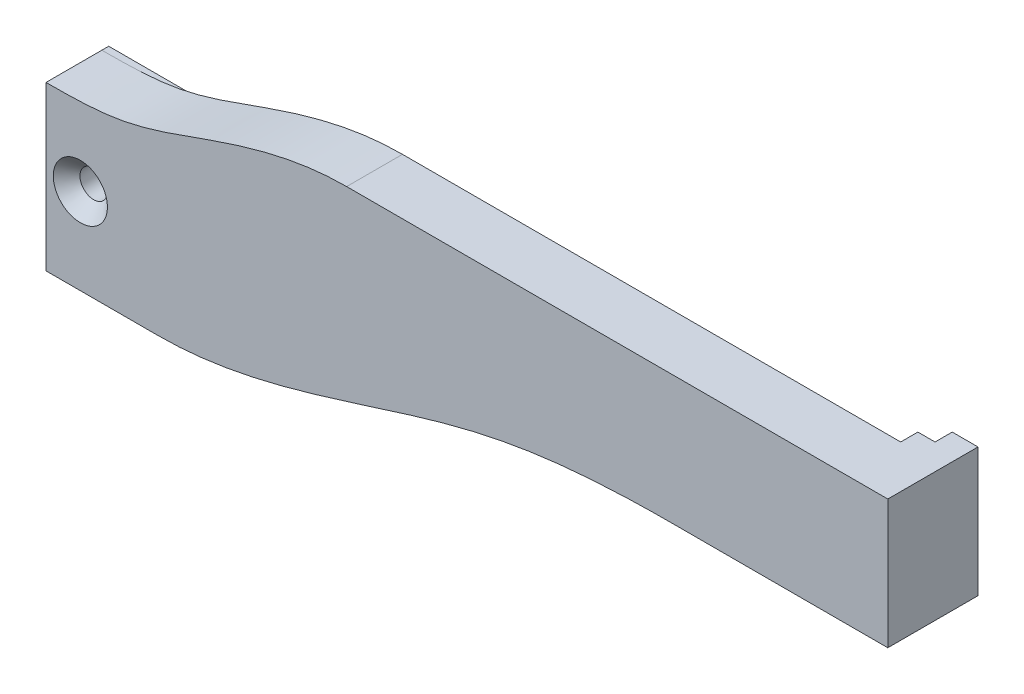
ISO-10303-21;
HEADER;
FILE_DESCRIPTION(('STEP AP214'),'2;1');
FILE_NAME('part.step','',(''),(''),'','','');
FILE_SCHEMA(('AUTOMOTIVE_DESIGN { 1 0 10303 214 1 1 1 1 }'));
ENDSEC;
DATA;
#1=APPLICATION_CONTEXT('core data for automotive mechanical design processes');
#2=APPLICATION_PROTOCOL_DEFINITION('international standard','automotive_design',2000,#1);
#3=PRODUCT_CONTEXT('',#1,'mechanical');
#4=PRODUCT('Part','Part','',(#3));
#5=PRODUCT_RELATED_PRODUCT_CATEGORY('part','',(#4));
#6=PRODUCT_DEFINITION_FORMATION('','',#4);
#7=PRODUCT_DEFINITION_CONTEXT('part definition',#1,'design');
#8=PRODUCT_DEFINITION('design','',#6,#7);
#9=PRODUCT_DEFINITION_SHAPE('','',#8);
#10=(LENGTH_UNIT() NAMED_UNIT(*) SI_UNIT(.MILLI.,.METRE.));
#11=(NAMED_UNIT(*) PLANE_ANGLE_UNIT() SI_UNIT($,.RADIAN.));
#12=(NAMED_UNIT(*) SI_UNIT($,.STERADIAN.) SOLID_ANGLE_UNIT());
#13=UNCERTAINTY_MEASURE_WITH_UNIT(LENGTH_MEASURE(1.E-05),#10,'distance_accuracy_value','');
#14=(GEOMETRIC_REPRESENTATION_CONTEXT(3) GLOBAL_UNCERTAINTY_ASSIGNED_CONTEXT((#13)) GLOBAL_UNIT_ASSIGNED_CONTEXT((#10,
#11,#12)) REPRESENTATION_CONTEXT('',''));
#15=CARTESIAN_POINT('',(0.,0.,0.));
#16=DIRECTION('',(0.,0.,1.));
#17=DIRECTION('',(1.,0.,0.));
#18=AXIS2_PLACEMENT_3D('',#15,#16,#17);
#19=CARTESIAN_POINT('',(0.,0.,0.));
#20=DIRECTION('',(0.,0.,-1.));
#21=DIRECTION('',(-1.,0.,0.));
#22=AXIS2_PLACEMENT_3D('',#19,#20,#21);
#23=PLANE('',#22);
#24=CARTESIAN_POINT('',(-49.7226680854989,56.4584902718559,0.));
#25=DIRECTION('',(0.,0.,-1.));
#26=DIRECTION('',(-1.,0.,0.));
#27=AXIS2_PLACEMENT_3D('',#24,#25,#26);
#28=CIRCLE('',#27,1.59999999999999);
#29=CARTESIAN_POINT('',(-51.3226680854989,56.4584902718559,0.));
#30=VERTEX_POINT('',#29);
#31=EDGE_CURVE('E41',#30,#30,#28,.T.);
#32=ORIENTED_EDGE('',*,*,#31,.F.);
#33=EDGE_LOOP('',(#32));
#34=FACE_BOUND('',#33,.T.);
#35=CARTESIAN_POINT('',(-44.1226680854821,62.0584902718545,0.));
#36=DIRECTION('',(0.,0.,1.));
#37=DIRECTION('',(-1.,0.,0.));
#38=AXIS2_PLACEMENT_3D('',#35,#36,#37);
#39=CIRCLE('',#38,0.899999999999998);
#40=CARTESIAN_POINT('',(-43.2226680854821,62.0584902718545,0.));
#41=VERTEX_POINT('',#40);
#42=CARTESIAN_POINT('',(-44.1226680854821,62.9584902718545,0.));
#43=VERTEX_POINT('',#42);
#44=EDGE_CURVE('E247',#41,#43,#39,.T.);
#45=ORIENTED_EDGE('',*,*,#44,.F.);
#46=DIRECTION('',(0.,1.,0.));
#47=VECTOR('',#46,1.);
#48=CARTESIAN_POINT('',(-43.2226680854821,62.0584902718545,0.));
#49=LINE('',#48,#47);
#50=CARTESIAN_POINT('',(-43.2226680854821,46.4584902718545,0.));
#51=VERTEX_POINT('',#50);
#52=EDGE_CURVE('E225',#51,#41,#49,.T.);
#53=ORIENTED_EDGE('',*,*,#52,.F.);
#54=DIRECTION('',(1.,0.,0.));
#55=VECTOR('',#54,1.);
#56=CARTESIAN_POINT('',(-53.7226680854821,46.4584902718545,0.));
#57=LINE('',#56,#55);
#58=CARTESIAN_POINT('',(-53.7226680854821,46.4584902718545,0.));
#59=VERTEX_POINT('',#58);
#60=EDGE_CURVE('E359',#59,#51,#57,.T.);
#61=ORIENTED_EDGE('',*,*,#60,.F.);
#62=DIRECTION('',(0.,-1.,0.));
#63=VECTOR('',#62,1.);
#64=CARTESIAN_POINT('',(-53.7226680854821,46.4584902718545,0.));
#65=LINE('',#64,#63);
#66=CARTESIAN_POINT('',(-53.7226680854821,62.9584902718545,0.));
#67=VERTEX_POINT('',#66);
#68=EDGE_CURVE('E346',#67,#59,#65,.T.);
#69=ORIENTED_EDGE('',*,*,#68,.F.);
#70=DIRECTION('',(-1.,0.,0.));
#71=VECTOR('',#70,1.);
#72=CARTESIAN_POINT('',(-53.7226680854821,62.9584902718545,0.));
#73=LINE('',#72,#71);
#74=EDGE_CURVE('E249',#43,#67,#73,.T.);
#75=ORIENTED_EDGE('',*,*,#74,.F.);
#76=EDGE_LOOP('',(#45,#53,#61,#69,#75));
#77=FACE_BOUND('',#76,.T.);
#78=ADVANCED_FACE('F36',(#34,#77),#23,.T.);
#79=CARTESIAN_POINT('',(-19.6476680854999,68.8834902718559,0.));
#80=DIRECTION('',(0.,0.,-1.));
#81=DIRECTION('',(-1.,0.,0.));
#82=AXIS2_PLACEMENT_3D('',#79,#80,#81);
#83=CIRCLE('',#82,2.);
#84=CARTESIAN_POINT('',(-21.6476680854999,68.8834902718559,0.));
#85=VERTEX_POINT('',#84);
#86=EDGE_CURVE('E527',#85,#85,#83,.T.);
#87=ORIENTED_EDGE('',*,*,#86,.F.);
#88=EDGE_LOOP('',(#87));
#89=FACE_BOUND('',#88,.T.);
#90=DIRECTION('',(0.707106781186547,-0.707106781186547,0.));
#91=VECTOR('',#90,1.);
#92=CARTESIAN_POINT('',(-40.7226680854821,64.9584902718545,0.));
#93=LINE('',#92,#91);
#94=CARTESIAN_POINT('',(-41.2226680854821,65.4584902718545,0.));
#95=VERTEX_POINT('',#94);
#96=CARTESIAN_POINT('',(-40.7226680854821,64.9584902718545,0.));
#97=VERTEX_POINT('',#96);
#98=EDGE_CURVE('E253',#95,#97,#93,.T.);
#99=ORIENTED_EDGE('',*,*,#98,.F.);
#100=DIRECTION('',(1.,0.,0.));
#101=VECTOR('',#100,1.);
#102=CARTESIAN_POINT('',(-41.2226680854821,65.4584902718545,0.));
#103=LINE('',#102,#101);
#104=CARTESIAN_POINT('',(-53.7226680854821,65.4584902718545,0.));
#105=VERTEX_POINT('',#104);
#106=EDGE_CURVE('E251',#105,#95,#103,.T.);
#107=ORIENTED_EDGE('',*,*,#106,.F.);
#108=CARTESIAN_POINT('',(-18.7226680854821,72.4584902718545,0.));
#109=CARTESIAN_POINT('',(-24.2377853639958,72.4584902718545,0.));
#110=CARTESIAN_POINT('',(-33.0451653637559,69.9964648024946,0.));
#111=CARTESIAN_POINT('',(-44.1783998760169,65.5488965573523,0.));
#112=CARTESIAN_POINT('',(-50.961091510957,65.4584902718545,0.));
#113=CARTESIAN_POINT('',(-53.7226680854821,65.4584902718545,0.));
#114=B_SPLINE_CURVE_WITH_KNOTS('',3,(#108,#109,#110,#111,#112,#113),.UNSPECIFIED.,.F.,.F.,(4,1,
1,4),(0.,0.451492406228631,0.761184280868583,1.),.UNSPECIFIED.);
#115=CARTESIAN_POINT('',(-18.7226680854821,72.4584902718545,0.));
#116=VERTEX_POINT('',#115);
#117=EDGE_CURVE('E368',#116,#105,#114,.T.);
#118=ORIENTED_EDGE('',*,*,#117,.F.);
#119=DIRECTION('',(-1.,0.,0.));
#120=VECTOR('',#119,1.);
#121=CARTESIAN_POINT('',(-53.7226680854821,72.4584902718545,0.));
#122=LINE('',#121,#120);
#123=CARTESIAN_POINT('',(39.2773319145179,72.4584902718545,0.));
#124=VERTEX_POINT('',#123);
#125=EDGE_CURVE('E350',#124,#116,#122,.T.);
#126=ORIENTED_EDGE('',*,*,#125,.F.);
#127=DIRECTION('',(0.,1.,0.));
#128=VECTOR('',#127,1.);
#129=CARTESIAN_POINT('',(39.2773319145179,70.4584902718545,0.));
#130=LINE('',#129,#128);
#131=CARTESIAN_POINT('',(39.2773319145179,70.4584902718545,0.));
#132=VERTEX_POINT('',#131);
#133=EDGE_CURVE('E334',#132,#124,#130,.T.);
#134=ORIENTED_EDGE('',*,*,#133,.F.);
#135=DIRECTION('',(-1.,0.,0.));
#136=VECTOR('',#135,1.);
#137=CARTESIAN_POINT('',(42.2773319145179,70.4584902718545,0.));
#138=LINE('',#137,#136);
#139=CARTESIAN_POINT('',(42.2773319145179,70.4584902718545,0.));
#140=VERTEX_POINT('',#139);
#141=EDGE_CURVE('E331',#140,#132,#138,.T.);
#142=ORIENTED_EDGE('',*,*,#141,.F.);
#143=DIRECTION('',(0.,1.,0.));
#144=VECTOR('',#143,1.);
#145=CARTESIAN_POINT('',(42.2773319145179,57.4584902718545,0.));
#146=LINE('',#145,#144);
#147=CARTESIAN_POINT('',(42.2773319145179,57.4584902718545,0.));
#148=VERTEX_POINT('',#147);
#149=EDGE_CURVE('E321',#148,#140,#146,.T.);
#150=ORIENTED_EDGE('',*,*,#149,.F.);
#151=DIRECTION('',(1.,0.,0.));
#152=VECTOR('',#151,1.);
#153=CARTESIAN_POINT('',(0.,57.4584902718545,0.));
#154=LINE('',#153,#152);
#155=CARTESIAN_POINT('',(19.2773319145179,57.4584902718545,0.));
#156=VERTEX_POINT('',#155);
#157=EDGE_CURVE('E318',#156,#148,#154,.T.);
#158=ORIENTED_EDGE('',*,*,#157,.F.);
#159=CARTESIAN_POINT('',(-40.7226680854821,46.4584902718545,0.));
#160=CARTESIAN_POINT('',(-29.5295788319542,46.4584902718546,0.));
#161=CARTESIAN_POINT('',(-8.90412174148208,55.1540178434076,0.));
#162=CARTESIAN_POINT('',(7.83294299235179,57.4584902718545,0.));
#163=CARTESIAN_POINT('',(19.2773319145179,57.4584902718545,0.));
#164=B_SPLINE_CURVE_WITH_KNOTS('',3,(#159,#160,#161,#162,#163),.UNSPECIFIED.,.F.,.F.,(4,1,4),
(0.,0.551294404892798,1.),.UNSPECIFIED.);
#165=CARTESIAN_POINT('',(-40.7226680854821,46.4584902718545,0.));
#166=VERTEX_POINT('',#165);
#167=EDGE_CURVE('E373',#166,#156,#164,.T.);
#168=ORIENTED_EDGE('',*,*,#167,.F.);
#169=DIRECTION('',(0.,-1.,0.));
#170=VECTOR('',#169,1.);
#171=CARTESIAN_POINT('',(-40.7226680854821,46.4584902718545,0.));
#172=LINE('',#171,#170);
#173=EDGE_CURVE('E230',#97,#166,#172,.T.);
#174=ORIENTED_EDGE('',*,*,#173,.F.);
#175=EDGE_LOOP('',(#99,#107,#118,#126,#134,#142,#150,#158,#168,#174));
#176=FACE_BOUND('',#175,.T.);
#177=ADVANCED_FACE('F414',(#89,#176),#23,.T.);
#178=CARTESIAN_POINT('',(-53.7226680854821,46.4584902718545,6.5));
#179=DIRECTION('',(0.,1.,0.));
#180=DIRECTION('',(0.,0.,1.));
#181=AXIS2_PLACEMENT_3D('',#178,#179,#180);
#182=PLANE('',#181);
#183=DIRECTION('',(0.,0.,-1.));
#184=VECTOR('',#183,1.);
#185=CARTESIAN_POINT('',(-40.7226680854821,46.4584902718545,6.5));
#186=LINE('',#185,#184);
#187=CARTESIAN_POINT('',(-40.7226680854821,46.4584902718545,6.5));
#188=VERTEX_POINT('',#187);
#189=EDGE_CURVE('E311',#188,#166,#186,.T.);
#190=ORIENTED_EDGE('',*,*,#189,.F.);
#191=DIRECTION('',(1.,0.,0.));
#192=VECTOR('',#191,1.);
#193=CARTESIAN_POINT('',(-53.7226680854821,46.4584902718545,6.5));
#194=LINE('',#193,#192);
#195=CARTESIAN_POINT('',(-53.7226680854821,46.4584902718545,6.5));
#196=VERTEX_POINT('',#195);
#197=EDGE_CURVE('E349',#196,#188,#194,.T.);
#198=ORIENTED_EDGE('',*,*,#197,.F.);
#199=DIRECTION('',(0.,0.,-1.));
#200=VECTOR('',#199,1.);
#201=CARTESIAN_POINT('',(-53.7226680854821,46.4584902718545,6.5));
#202=LINE('',#201,#200);
#203=EDGE_CURVE('E365',#196,#59,#202,.T.);
#204=ORIENTED_EDGE('',*,*,#203,.T.);
#205=ORIENTED_EDGE('',*,*,#60,.T.);
#206=DIRECTION('',(0.,0.,1.));
#207=VECTOR('',#206,1.);
#208=CARTESIAN_POINT('',(-43.2226680854821,46.4584902718545,-0.8));
#209=LINE('',#208,#207);
#210=CARTESIAN_POINT('',(-43.2226680854821,46.4584902718545,-0.8));
#211=VERTEX_POINT('',#210);
#212=EDGE_CURVE('E244',#211,#51,#209,.T.);
#213=ORIENTED_EDGE('',*,*,#212,.F.);
#214=DIRECTION('',(-1.,0.,0.));
#215=VECTOR('',#214,1.);
#216=CARTESIAN_POINT('',(-43.2226680854821,46.4584902718545,-0.8));
#217=LINE('',#216,#215);
#218=CARTESIAN_POINT('',(-40.7226680854821,46.4584902718545,-0.8));
#219=VERTEX_POINT('',#218);
#220=EDGE_CURVE('E242',#219,#211,#217,.T.);
#221=ORIENTED_EDGE('',*,*,#220,.F.);
#222=DIRECTION('',(0.,0.,1.));
#223=VECTOR('',#222,1.);
#224=CARTESIAN_POINT('',(-40.7226680854821,46.4584902718545,-0.8));
#225=LINE('',#224,#223);
#226=EDGE_CURVE('E258',#219,#166,#225,.T.);
#227=ORIENTED_EDGE('',*,*,#226,.T.);
#228=EDGE_LOOP('',(#190,#198,#204,#205,#213,#221,#227));
#229=FACE_BOUND('',#228,.T.);
#230=ADVANCED_FACE('F436',(#229),#182,.F.);
#231=CARTESIAN_POINT('',(-53.7226680854821,72.4584902718545,6.5));
#232=DIRECTION('',(0.,-1.,0.));
#233=DIRECTION('',(0.,0.,-1.));
#234=AXIS2_PLACEMENT_3D('',#231,#232,#233);
#235=PLANE('',#234);
#236=DIRECTION('',(0.,0.,-1.));
#237=VECTOR('',#236,1.);
#238=CARTESIAN_POINT('',(-18.7226680854821,72.4584902718545,6.5));
#239=LINE('',#238,#237);
#240=CARTESIAN_POINT('',(-18.7226680854821,72.4584902718545,6.5));
#241=VERTEX_POINT('',#240);
#242=EDGE_CURVE('E284',#241,#116,#239,.T.);
#243=ORIENTED_EDGE('',*,*,#242,.F.);
#244=DIRECTION('',(-1.,0.,0.));
#245=VECTOR('',#244,1.);
#246=CARTESIAN_POINT('',(-53.7226680854821,72.4584902718545,6.5));
#247=LINE('',#246,#245);
#248=CARTESIAN_POINT('',(44.2773319145179,72.4584902718545,6.5));
#249=VERTEX_POINT('',#248);
#250=EDGE_CURVE('E354',#249,#241,#247,.T.);
#251=ORIENTED_EDGE('',*,*,#250,.F.);
#252=DIRECTION('',(0.,0.,-1.));
#253=VECTOR('',#252,1.);
#254=CARTESIAN_POINT('',(44.2773319145179,72.4584902718545,6.5));
#255=LINE('',#254,#253);
#256=CARTESIAN_POINT('',(44.2773319145179,72.4584902718545,-4.));
#257=VERTEX_POINT('',#256);
#258=EDGE_CURVE('E357',#249,#257,#255,.T.);
#259=ORIENTED_EDGE('',*,*,#258,.T.);
#260=DIRECTION('',(1.,0.,0.));
#261=VECTOR('',#260,1.);
#262=CARTESIAN_POINT('',(44.2773319145179,72.4584902718545,-4.));
#263=LINE('',#262,#261);
#264=CARTESIAN_POINT('',(41.2773319145179,72.4584902718545,-4.));
#265=VERTEX_POINT('',#264);
#266=EDGE_CURVE('E207',#265,#257,#263,.T.);
#267=ORIENTED_EDGE('',*,*,#266,.F.);
#268=DIRECTION('',(0.,0.,1.));
#269=VECTOR('',#268,1.);
#270=CARTESIAN_POINT('',(41.2773319145179,72.4584902718545,-4.));
#271=LINE('',#270,#269);
#272=CARTESIAN_POINT('',(41.2773319145179,72.4584902718545,-2.));
#273=VERTEX_POINT('',#272);
#274=EDGE_CURVE('E220',#265,#273,#271,.T.);
#275=ORIENTED_EDGE('',*,*,#274,.T.);
#276=DIRECTION('',(1.,0.,0.));
#277=VECTOR('',#276,1.);
#278=CARTESIAN_POINT('',(39.2773319145179,72.4584902718545,-2.));
#279=LINE('',#278,#277);
#280=CARTESIAN_POINT('',(39.2773319145179,72.4584902718545,-2.));
#281=VERTEX_POINT('',#280);
#282=EDGE_CURVE('E193',#281,#273,#279,.T.);
#283=ORIENTED_EDGE('',*,*,#282,.F.);
#284=DIRECTION('',(0.,0.,1.));
#285=VECTOR('',#284,1.);
#286=CARTESIAN_POINT('',(39.2773319145179,72.4584902718545,-2.));
#287=LINE('',#286,#285);
#288=EDGE_CURVE('E192',#281,#124,#287,.T.);
#289=ORIENTED_EDGE('',*,*,#288,.T.);
#290=ORIENTED_EDGE('',*,*,#125,.T.);
#291=EDGE_LOOP('',(#243,#251,#259,#267,#275,#283,#289,#290));
#292=FACE_BOUND('',#291,.T.);
#293=ADVANCED_FACE('F401',(#292),#235,.F.);
#294=CARTESIAN_POINT('',(-53.7226680854821,46.4584902718545,6.5));
#295=DIRECTION('',(1.,0.,0.));
#296=DIRECTION('',(0.,0.,-1.));
#297=AXIS2_PLACEMENT_3D('',#294,#295,#296);
#298=PLANE('',#297);
#299=DIRECTION('',(0.,-1.,0.));
#300=VECTOR('',#299,1.);
#301=CARTESIAN_POINT('',(-53.7226680854821,46.4584902718545,6.5));
#302=LINE('',#301,#300);
#303=CARTESIAN_POINT('',(-53.7226680854821,65.4584902718545,6.5));
#304=VERTEX_POINT('',#303);
#305=EDGE_CURVE('E347',#304,#196,#302,.T.);
#306=ORIENTED_EDGE('',*,*,#305,.F.);
#307=DIRECTION('',(0.,0.,-1.));
#308=VECTOR('',#307,1.);
#309=CARTESIAN_POINT('',(-53.7226680854821,65.4584902718545,6.5));
#310=LINE('',#309,#308);
#311=EDGE_CURVE('E310',#304,#105,#310,.T.);
#312=ORIENTED_EDGE('',*,*,#311,.T.);
#313=DIRECTION('',(0.,0.,1.));
#314=VECTOR('',#313,1.);
#315=CARTESIAN_POINT('',(-53.7226680854821,65.4584902718545,-0.8));
#316=LINE('',#315,#314);
#317=CARTESIAN_POINT('',(-53.7226680854821,65.4584902718545,-0.8));
#318=VERTEX_POINT('',#317);
#319=EDGE_CURVE('E266',#318,#105,#316,.T.);
#320=ORIENTED_EDGE('',*,*,#319,.F.);
#321=DIRECTION('',(0.,1.,0.));
#322=VECTOR('',#321,1.);
#323=CARTESIAN_POINT('',(-53.7226680854821,65.4584902718545,-0.8));
#324=LINE('',#323,#322);
#325=CARTESIAN_POINT('',(-53.7226680854821,62.9584902718545,-0.8));
#326=VERTEX_POINT('',#325);
#327=EDGE_CURVE('E234',#326,#318,#324,.T.);
#328=ORIENTED_EDGE('',*,*,#327,.F.);
#329=DIRECTION('',(0.,0.,1.));
#330=VECTOR('',#329,1.);
#331=CARTESIAN_POINT('',(-53.7226680854821,62.9584902718545,-0.8));
#332=LINE('',#331,#330);
#333=EDGE_CURVE('E268',#326,#67,#332,.T.);
#334=ORIENTED_EDGE('',*,*,#333,.T.);
#335=ORIENTED_EDGE('',*,*,#68,.T.);
#336=ORIENTED_EDGE('',*,*,#203,.F.);
#337=EDGE_LOOP('',(#306,#312,#320,#328,#334,#335,#336));
#338=FACE_BOUND('',#337,.T.);
#339=ADVANCED_FACE('F445',(#338),#298,.F.);
#340=CARTESIAN_POINT('',(44.2773319145179,46.4584902718545,6.5));
#341=DIRECTION('',(-1.,0.,0.));
#342=DIRECTION('',(0.,-1.,0.));
#343=AXIS2_PLACEMENT_3D('',#340,#341,#342);
#344=PLANE('',#343);
#345=DIRECTION('',(0.,1.,0.));
#346=VECTOR('',#345,1.);
#347=CARTESIAN_POINT('',(44.2773319145179,46.4584902718545,6.5));
#348=LINE('',#347,#346);
#349=CARTESIAN_POINT('',(44.2773319145179,57.4584902718545,6.5));
#350=VERTEX_POINT('',#349);
#351=EDGE_CURVE('E188',#350,#249,#348,.T.);
#352=ORIENTED_EDGE('',*,*,#351,.F.);
#353=DIRECTION('',(0.,0.,1.));
#354=VECTOR('',#353,1.);
#355=CARTESIAN_POINT('',(44.2773319145179,57.4584902718545,-2.));
#356=LINE('',#355,#354);
#357=CARTESIAN_POINT('',(44.2773319145179,57.4584902718545,-4.));
#358=VERTEX_POINT('',#357);
#359=EDGE_CURVE('E182',#358,#350,#356,.T.);
#360=ORIENTED_EDGE('',*,*,#359,.F.);
#361=DIRECTION('',(0.,-1.,0.));
#362=VECTOR('',#361,1.);
#363=CARTESIAN_POINT('',(44.2773319145179,72.4584902718545,-4.));
#364=LINE('',#363,#362);
#365=EDGE_CURVE('E187',#257,#358,#364,.T.);
#366=ORIENTED_EDGE('',*,*,#365,.F.);
#367=ORIENTED_EDGE('',*,*,#258,.F.);
#368=EDGE_LOOP('',(#352,#360,#366,#367));
#369=FACE_BOUND('',#368,.T.);
#370=ADVANCED_FACE('F184',(#369),#344,.F.);
#371=CARTESIAN_POINT('',(0.,0.,6.5));
#372=DIRECTION('',(0.,0.,-1.));
#373=DIRECTION('',(-1.,0.,0.));
#374=AXIS2_PLACEMENT_3D('',#371,#372,#373);
#375=PLANE('',#374);
#376=CARTESIAN_POINT('',(-49.7226680854989,56.4584902718559,6.5));
#377=DIRECTION('',(0.,0.,1.));
#378=DIRECTION('',(1.,0.,0.));
#379=AXIS2_PLACEMENT_3D('',#376,#377,#378);
#380=CIRCLE('',#379,3.15);
#381=CARTESIAN_POINT('',(-46.5726680854989,56.4584902718559,6.5));
#382=VERTEX_POINT('',#381);
#383=EDGE_CURVE('E526',#382,#382,#380,.T.);
#384=ORIENTED_EDGE('',*,*,#383,.F.);
#385=EDGE_LOOP('',(#384));
#386=FACE_BOUND('',#385,.T.);
#387=CARTESIAN_POINT('',(-40.7226680854821,46.4584902718545,6.5));
#388=CARTESIAN_POINT('',(-29.5295788319542,46.4584902718546,6.5));
#389=CARTESIAN_POINT('',(-8.90412174148208,55.1540178434076,6.5));
#390=CARTESIAN_POINT('',(7.83294299235179,57.4584902718545,6.5));
#391=CARTESIAN_POINT('',(19.2773319145179,57.4584902718545,6.5));
#392=B_SPLINE_CURVE_WITH_KNOTS('',3,(#387,#388,#389,#390,#391),.UNSPECIFIED.,.F.,.F.,(4,1,4),
(0.,0.551294404892798,1.),.UNSPECIFIED.);
#393=CARTESIAN_POINT('',(19.2773319145179,57.4584902718545,6.5));
#394=VERTEX_POINT('',#393);
#395=EDGE_CURVE('E277',#188,#394,#392,.T.);
#396=ORIENTED_EDGE('',*,*,#395,.T.);
#397=DIRECTION('',(1.,0.,0.));
#398=VECTOR('',#397,1.);
#399=CARTESIAN_POINT('',(44.2773319145179,57.4584902718545,6.5));
#400=LINE('',#399,#398);
#401=EDGE_CURVE('E283',#394,#350,#400,.T.);
#402=ORIENTED_EDGE('',*,*,#401,.T.);
#403=ORIENTED_EDGE('',*,*,#351,.T.);
#404=ORIENTED_EDGE('',*,*,#250,.T.);
#405=CARTESIAN_POINT('',(-18.7226680854821,72.4584902718545,6.5));
#406=CARTESIAN_POINT('',(-24.2377853639958,72.4584902718545,6.5));
#407=CARTESIAN_POINT('',(-33.0451653637559,69.9964648024946,6.5));
#408=CARTESIAN_POINT('',(-44.1783998760169,65.5488965573523,6.5));
#409=CARTESIAN_POINT('',(-50.961091510957,65.4584902718545,6.5));
#410=CARTESIAN_POINT('',(-53.7226680854821,65.4584902718545,6.5));
#411=B_SPLINE_CURVE_WITH_KNOTS('',3,(#405,#406,#407,#408,#409,#410),.UNSPECIFIED.,.F.,.F.,(4,1,
1,4),(0.,0.451492406228631,0.761184280868583,1.),.UNSPECIFIED.);
#412=EDGE_CURVE('E276',#241,#304,#411,.T.);
#413=ORIENTED_EDGE('',*,*,#412,.T.);
#414=ORIENTED_EDGE('',*,*,#305,.T.);
#415=ORIENTED_EDGE('',*,*,#197,.T.);
#416=EDGE_LOOP('',(#396,#402,#403,#404,#413,#414,#415));
#417=FACE_BOUND('',#416,.T.);
#418=ADVANCED_FACE('F404',(#386,#417),#375,.F.);
#419=CARTESIAN_POINT('',(44.2773319145179,57.4584902718545,-2.));
#420=DIRECTION('',(0.,1.,0.));
#421=DIRECTION('',(0.,0.,1.));
#422=AXIS2_PLACEMENT_3D('',#419,#420,#421);
#423=PLANE('',#422);
#424=ORIENTED_EDGE('',*,*,#359,.T.);
#425=ORIENTED_EDGE('',*,*,#401,.F.);
#426=DIRECTION('',(0.,0.,-1.));
#427=VECTOR('',#426,1.);
#428=CARTESIAN_POINT('',(19.2773319145179,57.4584902718545,6.5));
#429=LINE('',#428,#427);
#430=EDGE_CURVE('E322',#394,#156,#429,.T.);
#431=ORIENTED_EDGE('',*,*,#430,.T.);
#432=ORIENTED_EDGE('',*,*,#157,.T.);
#433=DIRECTION('',(0.,0.,1.));
#434=VECTOR('',#433,1.);
#435=CARTESIAN_POINT('',(42.2773319145179,57.4584902718545,-2.));
#436=LINE('',#435,#434);
#437=CARTESIAN_POINT('',(42.2773319145179,57.4584902718545,-1.2));
#438=VERTEX_POINT('',#437);
#439=EDGE_CURVE('E344',#438,#148,#436,.T.);
#440=ORIENTED_EDGE('',*,*,#439,.F.);
#441=DIRECTION('',(0.707106781186548,0.,0.707106781186548));
#442=VECTOR('',#441,1.);
#443=CARTESIAN_POINT('',(42.8773319145179,57.4584902718545,-0.600000000000002));
#444=LINE('',#443,#442);
#445=CARTESIAN_POINT('',(41.4773319145179,57.4584902718545,-2.));
#446=VERTEX_POINT('',#445);
#447=EDGE_CURVE('E11',#438,#446,#444,.F.);
#448=ORIENTED_EDGE('',*,*,#447,.T.);
#449=DIRECTION('',(-1.,0.,0.));
#450=VECTOR('',#449,1.);
#451=CARTESIAN_POINT('',(44.2773319145179,57.4584902718545,-2.));
#452=LINE('',#451,#450);
#453=CARTESIAN_POINT('',(41.2773319145179,57.4584902718545,-2.));
#454=VERTEX_POINT('',#453);
#455=EDGE_CURVE('E211',#446,#454,#452,.T.);
#456=ORIENTED_EDGE('',*,*,#455,.T.);
#457=DIRECTION('',(0.,0.,1.));
#458=VECTOR('',#457,1.);
#459=CARTESIAN_POINT('',(41.2773319145179,57.4584902718545,-4.));
#460=LINE('',#459,#458);
#461=CARTESIAN_POINT('',(41.2773319145179,57.4584902718545,-4.));
#462=VERTEX_POINT('',#461);
#463=EDGE_CURVE('E199',#462,#454,#460,.T.);
#464=ORIENTED_EDGE('',*,*,#463,.F.);
#465=DIRECTION('',(-1.,0.,0.));
#466=VECTOR('',#465,1.);
#467=CARTESIAN_POINT('',(44.2773319145179,57.4584902718545,-4.));
#468=LINE('',#467,#466);
#469=EDGE_CURVE('E196',#358,#462,#468,.T.);
#470=ORIENTED_EDGE('',*,*,#469,.F.);
#471=EDGE_LOOP('',(#424,#425,#431,#432,#440,#448,#456,#464,#470));
#472=FACE_BOUND('',#471,.T.);
#473=ADVANCED_FACE('F197',(#472),#423,.F.);
#474=CARTESIAN_POINT('',(42.2773319145179,57.4584902718545,-2.));
#475=DIRECTION('',(1.,0.,0.));
#476=DIRECTION('',(0.,0.,-1.));
#477=AXIS2_PLACEMENT_3D('',#474,#475,#476);
#478=PLANE('',#477);
#479=DIRECTION('',(0.,0.,1.));
#480=VECTOR('',#479,1.);
#481=CARTESIAN_POINT('',(42.2773319145179,70.4584902718545,-2.));
#482=LINE('',#481,#480);
#483=CARTESIAN_POINT('',(42.2773319145179,70.4584902718545,-1.2));
#484=VERTEX_POINT('',#483);
#485=EDGE_CURVE('E342',#484,#140,#482,.T.);
#486=ORIENTED_EDGE('',*,*,#485,.F.);
#487=DIRECTION('',(0.,-1.,0.));
#488=VECTOR('',#487,1.);
#489=CARTESIAN_POINT('',(42.2773319145179,57.4584902718545,-1.2));
#490=LINE('',#489,#488);
#491=EDGE_CURVE('E46',#484,#438,#490,.T.);
#492=ORIENTED_EDGE('',*,*,#491,.T.);
#493=ORIENTED_EDGE('',*,*,#439,.T.);
#494=ORIENTED_EDGE('',*,*,#149,.T.);
#495=EDGE_LOOP('',(#486,#492,#493,#494));
#496=FACE_BOUND('',#495,.T.);
#497=ADVANCED_FACE('F417',(#496),#478,.F.);
#498=CARTESIAN_POINT('',(42.2773319145179,70.4584902718545,-2.));
#499=DIRECTION('',(0.,1.,0.));
#500=DIRECTION('',(0.,0.,1.));
#501=AXIS2_PLACEMENT_3D('',#498,#499,#500);
#502=PLANE('',#501);
#503=DIRECTION('',(-1.,0.,0.));
#504=VECTOR('',#503,1.);
#505=CARTESIAN_POINT('',(42.2773319145179,70.4584902718545,-2.));
#506=LINE('',#505,#504);
#507=CARTESIAN_POINT('',(41.4773319145179,70.4584902718545,-2.));
#508=VERTEX_POINT('',#507);
#509=CARTESIAN_POINT('',(41.2773319145179,70.4584902718545,-2.));
#510=VERTEX_POINT('',#509);
#511=EDGE_CURVE('E323',#508,#510,#506,.T.);
#512=ORIENTED_EDGE('',*,*,#511,.F.);
#513=DIRECTION('',(-0.707106781186548,0.,-0.707106781186548));
#514=VECTOR('',#513,1.);
#515=CARTESIAN_POINT('',(41.4773319145179,70.4584902718545,-2.));
#516=LINE('',#515,#514);
#517=EDGE_CURVE('E60',#508,#484,#516,.F.);
#518=ORIENTED_EDGE('',*,*,#517,.T.);
#519=ORIENTED_EDGE('',*,*,#485,.T.);
#520=ORIENTED_EDGE('',*,*,#141,.T.);
#521=DIRECTION('',(0.,0.,1.));
#522=VECTOR('',#521,1.);
#523=CARTESIAN_POINT('',(39.2773319145179,70.4584902718545,-2.));
#524=LINE('',#523,#522);
#525=CARTESIAN_POINT('',(39.2773319145179,70.4584902718545,-2.));
#526=VERTEX_POINT('',#525);
#527=EDGE_CURVE('E339',#526,#132,#524,.T.);
#528=ORIENTED_EDGE('',*,*,#527,.F.);
#529=EDGE_CURVE('E326',#510,#526,#506,.T.);
#530=ORIENTED_EDGE('',*,*,#529,.F.);
#531=EDGE_LOOP('',(#512,#518,#519,#520,#528,#530));
#532=FACE_BOUND('',#531,.T.);
#533=ADVANCED_FACE('F548',(#532),#502,.F.);
#534=CARTESIAN_POINT('',(39.2773319145179,70.4584902718545,-2.));
#535=DIRECTION('',(1.,0.,0.));
#536=DIRECTION('',(0.,0.,-1.));
#537=AXIS2_PLACEMENT_3D('',#534,#535,#536);
#538=PLANE('',#537);
#539=ORIENTED_EDGE('',*,*,#133,.T.);
#540=ORIENTED_EDGE('',*,*,#288,.F.);
#541=DIRECTION('',(0.,1.,0.));
#542=VECTOR('',#541,1.);
#543=CARTESIAN_POINT('',(39.2773319145179,70.4584902718545,-2.));
#544=LINE('',#543,#542);
#545=EDGE_CURVE('E325',#526,#281,#544,.T.);
#546=ORIENTED_EDGE('',*,*,#545,.F.);
#547=ORIENTED_EDGE('',*,*,#527,.T.);
#548=EDGE_LOOP('',(#539,#540,#546,#547));
#549=FACE_BOUND('',#548,.T.);
#550=ADVANCED_FACE('F552',(#549),#538,.F.);
#551=CARTESIAN_POINT('',(0.,0.,-2.));
#552=DIRECTION('',(0.,0.,-1.));
#553=DIRECTION('',(-1.,0.,0.));
#554=AXIS2_PLACEMENT_3D('',#551,#552,#553);
#555=PLANE('',#554);
#556=DIRECTION('',(0.,1.,0.));
#557=VECTOR('',#556,1.);
#558=CARTESIAN_POINT('',(41.2773319145179,72.4584902718545,-2.));
#559=LINE('',#558,#557);
#560=EDGE_CURVE('E213',#510,#273,#559,.T.);
#561=ORIENTED_EDGE('',*,*,#560,.F.);
#562=ORIENTED_EDGE('',*,*,#529,.T.);
#563=ORIENTED_EDGE('',*,*,#545,.T.);
#564=ORIENTED_EDGE('',*,*,#282,.T.);
#565=EDGE_LOOP('',(#561,#562,#563,#564));
#566=FACE_BOUND('',#565,.T.);
#567=ADVANCED_FACE('F301',(#566),#555,.T.);
#568=DIRECTION('',(0.,0.,-1.));
#569=VECTOR('',#568,1.);
#570=SURFACE_OF_LINEAR_EXTRUSION('',#411,#569);
#571=ORIENTED_EDGE('',*,*,#117,.T.);
#572=ORIENTED_EDGE('',*,*,#311,.F.);
#573=ORIENTED_EDGE('',*,*,#412,.F.);
#574=ORIENTED_EDGE('',*,*,#242,.T.);
#575=EDGE_LOOP('',(#571,#572,#573,#574));
#576=FACE_BOUND('',#575,.T.);
#577=ADVANCED_FACE('F295',(#576),#570,.F.);
#578=DIRECTION('',(0.,0.,-1.));
#579=VECTOR('',#578,1.);
#580=SURFACE_OF_LINEAR_EXTRUSION('',#392,#579);
#581=ORIENTED_EDGE('',*,*,#167,.T.);
#582=ORIENTED_EDGE('',*,*,#430,.F.);
#583=ORIENTED_EDGE('',*,*,#395,.F.);
#584=ORIENTED_EDGE('',*,*,#189,.T.);
#585=EDGE_LOOP('',(#581,#582,#583,#584));
#586=FACE_BOUND('',#585,.T.);
#587=ADVANCED_FACE('F290',(#586),#580,.F.);
#588=CARTESIAN_POINT('',(-43.2226680854821,62.0584902718545,-0.8));
#589=DIRECTION('',(1.,0.,0.));
#590=DIRECTION('',(0.,0.,-1.));
#591=AXIS2_PLACEMENT_3D('',#588,#589,#590);
#592=PLANE('',#591);
#593=ORIENTED_EDGE('',*,*,#52,.T.);
#594=DIRECTION('',(0.,0.,1.));
#595=VECTOR('',#594,1.);
#596=CARTESIAN_POINT('',(-43.2226680854821,62.0584902718545,-0.8));
#597=LINE('',#596,#595);
#598=CARTESIAN_POINT('',(-43.2226680854821,62.0584902718545,-0.8));
#599=VERTEX_POINT('',#598);
#600=EDGE_CURVE('E274',#599,#41,#597,.T.);
#601=ORIENTED_EDGE('',*,*,#600,.F.);
#602=DIRECTION('',(0.,1.,0.));
#603=VECTOR('',#602,1.);
#604=CARTESIAN_POINT('',(-43.2226680854821,62.0584902718545,-0.8));
#605=LINE('',#604,#603);
#606=EDGE_CURVE('E226',#211,#599,#605,.T.);
#607=ORIENTED_EDGE('',*,*,#606,.F.);
#608=ORIENTED_EDGE('',*,*,#212,.T.);
#609=EDGE_LOOP('',(#593,#601,#607,#608));
#610=FACE_BOUND('',#609,.T.);
#611=ADVANCED_FACE('F294',(#610),#592,.F.);
#612=CARTESIAN_POINT('',(-44.1226680854821,62.0584902718545,-0.8));
#613=DIRECTION('',(0.,0.,1.));
#614=DIRECTION('',(1.,0.,0.));
#615=AXIS2_PLACEMENT_3D('',#612,#613,#614);
#616=CYLINDRICAL_SURFACE('',#615,0.899999999999998);
#617=ORIENTED_EDGE('',*,*,#44,.T.);
#618=DIRECTION('',(0.,0.,1.));
#619=VECTOR('',#618,1.);
#620=CARTESIAN_POINT('',(-44.1226680854821,62.9584902718545,-0.8));
#621=LINE('',#620,#619);
#622=CARTESIAN_POINT('',(-44.1226680854821,62.9584902718545,-0.8));
#623=VERTEX_POINT('',#622);
#624=EDGE_CURVE('E271',#623,#43,#621,.T.);
#625=ORIENTED_EDGE('',*,*,#624,.F.);
#626=CARTESIAN_POINT('',(-44.1226680854821,62.0584902718545,-0.8));
#627=DIRECTION('',(0.,0.,1.));
#628=DIRECTION('',(-1.,0.,0.));
#629=AXIS2_PLACEMENT_3D('',#626,#627,#628);
#630=CIRCLE('',#629,0.899999999999998);
#631=EDGE_CURVE('E229',#599,#623,#630,.T.);
#632=ORIENTED_EDGE('',*,*,#631,.F.);
#633=ORIENTED_EDGE('',*,*,#600,.T.);
#634=EDGE_LOOP('',(#617,#625,#632,#633));
#635=FACE_BOUND('',#634,.T.);
#636=ADVANCED_FACE('F490',(#635),#616,.F.);
#637=CARTESIAN_POINT('',(-53.7226680854821,62.9584902718545,-0.8));
#638=DIRECTION('',(0.,1.,0.));
#639=DIRECTION('',(0.,0.,1.));
#640=AXIS2_PLACEMENT_3D('',#637,#638,#639);
#641=PLANE('',#640);
#642=ORIENTED_EDGE('',*,*,#74,.T.);
#643=ORIENTED_EDGE('',*,*,#333,.F.);
#644=DIRECTION('',(-1.,0.,0.));
#645=VECTOR('',#644,1.);
#646=CARTESIAN_POINT('',(-53.7226680854821,62.9584902718545,-0.8));
#647=LINE('',#646,#645);
#648=EDGE_CURVE('E232',#623,#326,#647,.T.);
#649=ORIENTED_EDGE('',*,*,#648,.F.);
#650=ORIENTED_EDGE('',*,*,#624,.T.);
#651=EDGE_LOOP('',(#642,#643,#649,#650));
#652=FACE_BOUND('',#651,.T.);
#653=ADVANCED_FACE('F481',(#652),#641,.F.);
#654=CARTESIAN_POINT('',(-41.2226680854821,65.4584902718545,-0.8));
#655=DIRECTION('',(0.,-1.,0.));
#656=DIRECTION('',(0.,0.,-1.));
#657=AXIS2_PLACEMENT_3D('',#654,#655,#656);
#658=PLANE('',#657);
#659=ORIENTED_EDGE('',*,*,#106,.T.);
#660=DIRECTION('',(0.,0.,1.));
#661=VECTOR('',#660,1.);
#662=CARTESIAN_POINT('',(-41.2226680854821,65.4584902718545,-0.8));
#663=LINE('',#662,#661);
#664=CARTESIAN_POINT('',(-41.2226680854821,65.4584902718545,-0.8));
#665=VERTEX_POINT('',#664);
#666=EDGE_CURVE('E263',#665,#95,#663,.T.);
#667=ORIENTED_EDGE('',*,*,#666,.F.);
#668=DIRECTION('',(1.,0.,0.));
#669=VECTOR('',#668,1.);
#670=CARTESIAN_POINT('',(-41.2226680854821,65.4584902718545,-0.8));
#671=LINE('',#670,#669);
#672=EDGE_CURVE('E236',#318,#665,#671,.T.);
#673=ORIENTED_EDGE('',*,*,#672,.F.);
#674=ORIENTED_EDGE('',*,*,#319,.T.);
#675=EDGE_LOOP('',(#659,#667,#673,#674));
#676=FACE_BOUND('',#675,.T.);
#677=ADVANCED_FACE('F472',(#676),#658,.F.);
#678=CARTESIAN_POINT('',(-40.7226680854821,64.9584902718545,-0.8));
#679=DIRECTION('',(-0.707106781186548,-0.707106781186548,0.));
#680=DIRECTION('',(0.707106781186548,-0.707106781186548,0.));
#681=AXIS2_PLACEMENT_3D('',#678,#679,#680);
#682=PLANE('',#681);
#683=ORIENTED_EDGE('',*,*,#98,.T.);
#684=DIRECTION('',(0.,0.,1.));
#685=VECTOR('',#684,1.);
#686=CARTESIAN_POINT('',(-40.7226680854821,64.9584902718545,-0.8));
#687=LINE('',#686,#685);
#688=CARTESIAN_POINT('',(-40.7226680854821,64.9584902718545,-0.8));
#689=VERTEX_POINT('',#688);
#690=EDGE_CURVE('E260',#689,#97,#687,.T.);
#691=ORIENTED_EDGE('',*,*,#690,.F.);
#692=DIRECTION('',(0.707106781186547,-0.707106781186547,0.));
#693=VECTOR('',#692,1.);
#694=CARTESIAN_POINT('',(-40.7226680854821,64.9584902718545,-0.8));
#695=LINE('',#694,#693);
#696=EDGE_CURVE('E238',#665,#689,#695,.T.);
#697=ORIENTED_EDGE('',*,*,#696,.F.);
#698=ORIENTED_EDGE('',*,*,#666,.T.);
#699=EDGE_LOOP('',(#683,#691,#697,#698));
#700=FACE_BOUND('',#699,.T.);
#701=ADVANCED_FACE('F467',(#700),#682,.F.);
#702=CARTESIAN_POINT('',(-40.7226680854821,46.4584902718545,-0.8));
#703=DIRECTION('',(-1.,0.,0.));
#704=DIRECTION('',(0.,0.,1.));
#705=AXIS2_PLACEMENT_3D('',#702,#703,#704);
#706=PLANE('',#705);
#707=ORIENTED_EDGE('',*,*,#173,.T.);
#708=ORIENTED_EDGE('',*,*,#226,.F.);
#709=DIRECTION('',(0.,-1.,0.));
#710=VECTOR('',#709,1.);
#711=CARTESIAN_POINT('',(-40.7226680854821,46.4584902718545,-0.8));
#712=LINE('',#711,#710);
#713=EDGE_CURVE('E240',#689,#219,#712,.T.);
#714=ORIENTED_EDGE('',*,*,#713,.F.);
#715=ORIENTED_EDGE('',*,*,#690,.T.);
#716=EDGE_LOOP('',(#707,#708,#714,#715));
#717=FACE_BOUND('',#716,.T.);
#718=ADVANCED_FACE('F462',(#717),#706,.F.);
#719=CARTESIAN_POINT('',(-44.1226680854821,62.0584902718545,-0.8));
#720=DIRECTION('',(0.,0.,-1.));
#721=DIRECTION('',(-1.,0.,0.));
#722=AXIS2_PLACEMENT_3D('',#719,#720,#721);
#723=PLANE('',#722);
#724=ORIENTED_EDGE('',*,*,#606,.T.);
#725=ORIENTED_EDGE('',*,*,#631,.T.);
#726=ORIENTED_EDGE('',*,*,#648,.T.);
#727=ORIENTED_EDGE('',*,*,#327,.T.);
#728=ORIENTED_EDGE('',*,*,#672,.T.);
#729=ORIENTED_EDGE('',*,*,#696,.T.);
#730=ORIENTED_EDGE('',*,*,#713,.T.);
#731=ORIENTED_EDGE('',*,*,#220,.T.);
#732=EDGE_LOOP('',(#724,#725,#726,#727,#728,#729,#730,#731));
#733=FACE_BOUND('',#732,.T.);
#734=ADVANCED_FACE('F477',(#733),#723,.T.);
#735=CARTESIAN_POINT('',(0.,0.,-2.));
#736=DIRECTION('',(0.,0.,-1.));
#737=DIRECTION('',(-1.,0.,0.));
#738=AXIS2_PLACEMENT_3D('',#735,#736,#737);
#739=PLANE('',#738);
#740=ORIENTED_EDGE('',*,*,#455,.F.);
#741=DIRECTION('',(0.,1.,0.));
#742=VECTOR('',#741,1.);
#743=CARTESIAN_POINT('',(41.4773319145179,70.4584902718545,-2.));
#744=LINE('',#743,#742);
#745=EDGE_CURVE('E380',#446,#508,#744,.T.);
#746=ORIENTED_EDGE('',*,*,#745,.T.);
#747=ORIENTED_EDGE('',*,*,#511,.T.);
#748=EDGE_CURVE('E208',#454,#510,#559,.T.);
#749=ORIENTED_EDGE('',*,*,#748,.F.);
#750=EDGE_LOOP('',(#740,#746,#747,#749));
#751=FACE_BOUND('',#750,.T.);
#752=ADVANCED_FACE('F506',(#751),#739,.F.);
#753=CARTESIAN_POINT('',(41.2773319145179,72.4584902718545,-4.));
#754=DIRECTION('',(1.,0.,0.));
#755=DIRECTION('',(0.,0.,-1.));
#756=AXIS2_PLACEMENT_3D('',#753,#754,#755);
#757=PLANE('',#756);
#758=ORIENTED_EDGE('',*,*,#748,.T.);
#759=ORIENTED_EDGE('',*,*,#560,.T.);
#760=ORIENTED_EDGE('',*,*,#274,.F.);
#761=DIRECTION('',(0.,1.,0.));
#762=VECTOR('',#761,1.);
#763=CARTESIAN_POINT('',(41.2773319145179,72.4584902718545,-4.));
#764=LINE('',#763,#762);
#765=EDGE_CURVE('E202',#462,#265,#764,.T.);
#766=ORIENTED_EDGE('',*,*,#765,.F.);
#767=ORIENTED_EDGE('',*,*,#463,.T.);
#768=EDGE_LOOP('',(#758,#759,#760,#766,#767));
#769=FACE_BOUND('',#768,.T.);
#770=ADVANCED_FACE('F394',(#769),#757,.F.);
#771=CARTESIAN_POINT('',(0.,0.,-4.));
#772=DIRECTION('',(0.,0.,-1.));
#773=DIRECTION('',(-1.,0.,0.));
#774=AXIS2_PLACEMENT_3D('',#771,#772,#773);
#775=PLANE('',#774);
#776=ORIENTED_EDGE('',*,*,#365,.T.);
#777=ORIENTED_EDGE('',*,*,#469,.T.);
#778=ORIENTED_EDGE('',*,*,#765,.T.);
#779=ORIENTED_EDGE('',*,*,#266,.T.);
#780=EDGE_LOOP('',(#776,#777,#778,#779));
#781=FACE_BOUND('',#780,.T.);
#782=ADVANCED_FACE('F205',(#781),#775,.T.);
#783=CARTESIAN_POINT('',(41.4773319145179,0.,-2.));
#784=DIRECTION('',(-0.707106781186548,0.,0.707106781186548));
#785=DIRECTION('',(0.,-1.,0.));
#786=AXIS2_PLACEMENT_3D('',#783,#784,#785);
#787=PLANE('',#786);
#788=ORIENTED_EDGE('',*,*,#447,.F.);
#789=ORIENTED_EDGE('',*,*,#491,.F.);
#790=ORIENTED_EDGE('',*,*,#517,.F.);
#791=ORIENTED_EDGE('',*,*,#745,.F.);
#792=EDGE_LOOP('',(#788,#789,#790,#791));
#793=FACE_BOUND('',#792,.T.);
#794=ADVANCED_FACE('F39',(#793),#787,.T.);
#795=CARTESIAN_POINT('',(-49.7226680854989,56.4584902718559,6.5));
#796=DIRECTION('',(0.,0.,1.));
#797=DIRECTION('',(1.,0.,0.));
#798=AXIS2_PLACEMENT_3D('',#795,#796,#797);
#799=CYLINDRICAL_SURFACE('',#798,1.59999999999999);
#800=ORIENTED_EDGE('',*,*,#31,.T.);
#801=EDGE_LOOP('',(#800));
#802=FACE_BOUND('',#801,.T.);
#803=CARTESIAN_POINT('',(-49.7226680854989,56.4584902718559,4.95));
#804=DIRECTION('',(0.,0.,1.));
#805=DIRECTION('',(1.,0.,0.));
#806=AXIS2_PLACEMENT_3D('',#803,#804,#805);
#807=CIRCLE('',#806,1.59999999999999);
#808=CARTESIAN_POINT('',(-48.1226680854989,56.4584902718559,4.95));
#809=VERTEX_POINT('',#808);
#810=EDGE_CURVE('E215',#809,#809,#807,.T.);
#811=ORIENTED_EDGE('',*,*,#810,.T.);
#812=EDGE_LOOP('',(#811));
#813=FACE_BOUND('',#812,.T.);
#814=ADVANCED_FACE('F421',(#802,#813),#799,.F.);
#815=CARTESIAN_POINT('',(-49.7226680854989,56.4584902718559,6.5));
#816=DIRECTION('',(0.,0.,1.));
#817=DIRECTION('',(1.,0.,0.));
#818=AXIS2_PLACEMENT_3D('',#815,#816,#817);
#819=CONICAL_SURFACE('',#818,3.15,0.785398163397452);
#820=ORIENTED_EDGE('',*,*,#810,.F.);
#821=EDGE_LOOP('',(#820));
#822=FACE_BOUND('',#821,.T.);
#823=ORIENTED_EDGE('',*,*,#383,.T.);
#824=EDGE_LOOP('',(#823));
#825=FACE_BOUND('',#824,.T.);
#826=ADVANCED_FACE('F426',(#822,#825),#819,.F.);
#827=CARTESIAN_POINT('',(-19.6476680854999,68.8834902718559,5.));
#828=DIRECTION('',(0.,0.,-1.));
#829=DIRECTION('',(-1.,0.,0.));
#830=AXIS2_PLACEMENT_3D('',#827,#828,#829);
#831=CYLINDRICAL_SURFACE('',#830,2.);
#832=CARTESIAN_POINT('',(-19.6476680854999,68.8834902718559,5.));
#833=DIRECTION('',(0.,0.,-1.));
#834=DIRECTION('',(-1.,0.,0.));
#835=AXIS2_PLACEMENT_3D('',#832,#833,#834);
#836=CIRCLE('',#835,2.);
#837=CARTESIAN_POINT('',(-21.6476680854999,68.8834902718559,5.));
#838=VERTEX_POINT('',#837);
#839=EDGE_CURVE('E525',#838,#838,#836,.T.);
#840=ORIENTED_EDGE('',*,*,#839,.F.);
#841=EDGE_LOOP('',(#840));
#842=FACE_BOUND('',#841,.T.);
#843=ORIENTED_EDGE('',*,*,#86,.T.);
#844=EDGE_LOOP('',(#843));
#845=FACE_BOUND('',#844,.T.);
#846=ADVANCED_FACE('F513',(#842,#845),#831,.F.);
#847=CARTESIAN_POINT('',(-19.6476680854999,68.8834902718559,5.));
#848=DIRECTION('',(0.,0.,-1.));
#849=DIRECTION('',(-1.,0.,0.));
#850=AXIS2_PLACEMENT_3D('',#847,#848,#849);
#851=PLANE('',#850);
#852=ORIENTED_EDGE('',*,*,#839,.T.);
#853=EDGE_LOOP('',(#852));
#854=FACE_BOUND('',#853,.T.);
#855=ADVANCED_FACE('F517',(#854),#851,.T.);
#856=CLOSED_SHELL('',(#78,#177,#230,#293,#339,#370,#418,#473,#497,#533,#550,#567,#577,#587,#611,
#636,#653,#677,#701,#718,#734,#752,#770,#782,#794,#814,#826,#846,#855));
#857=MANIFOLD_SOLID_BREP('B2',#856);
#858=ADVANCED_BREP_SHAPE_REPRESENTATION('',(#18,#857),#14);
#859=SHAPE_DEFINITION_REPRESENTATION(#9,#858);
ENDSEC;
END-ISO-10303-21;
